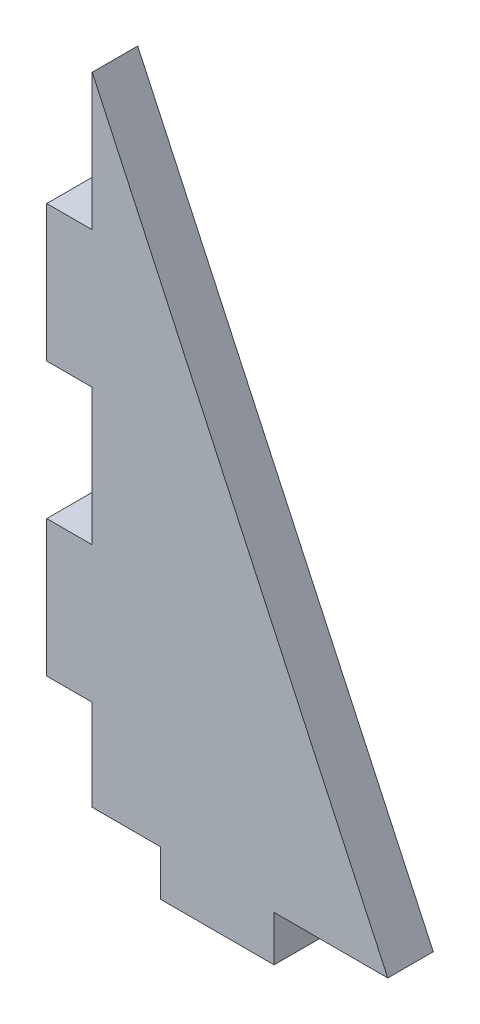
ISO-10303-21;
HEADER;
FILE_DESCRIPTION(('STEP AP214'),'2;1');
FILE_NAME('part.step','',(''),(''),'','','');
FILE_SCHEMA(('AUTOMOTIVE_DESIGN { 1 0 10303 214 1 1 1 1 }'));
ENDSEC;
DATA;
#1=APPLICATION_CONTEXT('core data for automotive mechanical design processes');
#2=APPLICATION_PROTOCOL_DEFINITION('international standard','automotive_design',2000,#1);
#3=PRODUCT_CONTEXT('',#1,'mechanical');
#4=PRODUCT('Part','Part','',(#3));
#5=PRODUCT_RELATED_PRODUCT_CATEGORY('part','',(#4));
#6=PRODUCT_DEFINITION_FORMATION('','',#4);
#7=PRODUCT_DEFINITION_CONTEXT('part definition',#1,'design');
#8=PRODUCT_DEFINITION('design','',#6,#7);
#9=PRODUCT_DEFINITION_SHAPE('','',#8);
#10=(LENGTH_UNIT() NAMED_UNIT(*) SI_UNIT(.MILLI.,.METRE.));
#11=(NAMED_UNIT(*) PLANE_ANGLE_UNIT() SI_UNIT($,.RADIAN.));
#12=(NAMED_UNIT(*) SI_UNIT($,.STERADIAN.) SOLID_ANGLE_UNIT());
#13=UNCERTAINTY_MEASURE_WITH_UNIT(LENGTH_MEASURE(1.E-05),#10,'distance_accuracy_value','');
#14=(GEOMETRIC_REPRESENTATION_CONTEXT(3) GLOBAL_UNCERTAINTY_ASSIGNED_CONTEXT((#13)) GLOBAL_UNIT_ASSIGNED_CONTEXT((#10,
#11,#12)) REPRESENTATION_CONTEXT('',''));
#15=CARTESIAN_POINT('',(0.,0.,0.));
#16=DIRECTION('',(0.,0.,1.));
#17=DIRECTION('',(1.,0.,0.));
#18=AXIS2_PLACEMENT_3D('',#15,#16,#17);
#19=CARTESIAN_POINT('',(38.1,0.,5.08));
#20=DIRECTION('',(0.,1.,0.));
#21=DIRECTION('',(-1.,0.,0.));
#22=AXIS2_PLACEMENT_3D('',#19,#20,#21);
#23=PLANE('',#22);
#24=DIRECTION('',(0.,0.,1.));
#25=VECTOR('',#24,1.);
#26=CARTESIAN_POINT('',(12.7,0.,0.));
#27=LINE('',#26,#25);
#28=CARTESIAN_POINT('',(12.7,0.,0.));
#29=VERTEX_POINT('',#28);
#30=CARTESIAN_POINT('',(12.7,0.,5.07999999999999));
#31=VERTEX_POINT('',#30);
#32=EDGE_CURVE('E202',#29,#31,#27,.T.);
#33=ORIENTED_EDGE('',*,*,#32,.F.);
#34=DIRECTION('',(1.,0.,0.));
#35=VECTOR('',#34,1.);
#36=CARTESIAN_POINT('',(38.1,0.,0.));
#37=LINE('',#36,#35);
#38=CARTESIAN_POINT('',(25.4,0.,0.));
#39=VERTEX_POINT('',#38);
#40=EDGE_CURVE('E169',#29,#39,#37,.T.);
#41=ORIENTED_EDGE('',*,*,#40,.T.);
#42=DIRECTION('',(0.,0.,1.));
#43=VECTOR('',#42,1.);
#44=CARTESIAN_POINT('',(25.4,0.,0.));
#45=LINE('',#44,#43);
#46=CARTESIAN_POINT('',(25.4,0.,5.08));
#47=VERTEX_POINT('',#46);
#48=EDGE_CURVE('E207',#39,#47,#45,.T.);
#49=ORIENTED_EDGE('',*,*,#48,.T.);
#50=DIRECTION('',(1.,0.,0.));
#51=VECTOR('',#50,1.);
#52=CARTESIAN_POINT('',(38.1,0.,5.08));
#53=LINE('',#52,#51);
#54=EDGE_CURVE('E238',#31,#47,#53,.T.);
#55=ORIENTED_EDGE('',*,*,#54,.F.);
#56=EDGE_LOOP('',(#33,#41,#49,#55));
#57=FACE_BOUND('',#56,.T.);
#58=ADVANCED_FACE('F32',(#57),#23,.F.);
#59=CARTESIAN_POINT('',(0.,0.,5.08));
#60=DIRECTION('',(1.,0.,0.));
#61=DIRECTION('',(0.,0.,-1.));
#62=AXIS2_PLACEMENT_3D('',#59,#60,#61);
#63=PLANE('',#62);
#64=DIRECTION('',(0.,0.,1.));
#65=VECTOR('',#64,1.);
#66=CARTESIAN_POINT('',(0.,60.96,0.));
#67=LINE('',#66,#65);
#68=CARTESIAN_POINT('',(0.,60.96,0.));
#69=VERTEX_POINT('',#68);
#70=CARTESIAN_POINT('',(0.,60.96,5.08));
#71=VERTEX_POINT('',#70);
#72=EDGE_CURVE('E157',#69,#71,#67,.T.);
#73=ORIENTED_EDGE('',*,*,#72,.F.);
#74=DIRECTION('',(0.,-1.,0.));
#75=VECTOR('',#74,1.);
#76=CARTESIAN_POINT('',(0.,0.,0.));
#77=LINE('',#76,#75);
#78=CARTESIAN_POINT('',(0.,45.72,0.));
#79=VERTEX_POINT('',#78);
#80=EDGE_CURVE('E162',#69,#79,#77,.T.);
#81=ORIENTED_EDGE('',*,*,#80,.T.);
#82=DIRECTION('',(0.,0.,1.));
#83=VECTOR('',#82,1.);
#84=CARTESIAN_POINT('',(0.,45.72,0.));
#85=LINE('',#84,#83);
#86=CARTESIAN_POINT('',(0.,45.72,5.08));
#87=VERTEX_POINT('',#86);
#88=EDGE_CURVE('E54',#79,#87,#85,.T.);
#89=ORIENTED_EDGE('',*,*,#88,.T.);
#90=DIRECTION('',(0.,-1.,0.));
#91=VECTOR('',#90,1.);
#92=CARTESIAN_POINT('',(0.,0.,5.08));
#93=LINE('',#92,#91);
#94=EDGE_CURVE('E247',#71,#87,#93,.T.);
#95=ORIENTED_EDGE('',*,*,#94,.F.);
#96=EDGE_LOOP('',(#73,#81,#89,#95));
#97=FACE_BOUND('',#96,.T.);
#98=ADVANCED_FACE('F260',(#97),#63,.F.);
#99=DIRECTION('',(0.,0.,1.));
#100=VECTOR('',#99,1.);
#101=CARTESIAN_POINT('',(0.,30.48,0.));
#102=LINE('',#101,#100);
#103=CARTESIAN_POINT('',(0.,30.48,0.));
#104=VERTEX_POINT('',#103);
#105=CARTESIAN_POINT('',(0.,30.48,5.08000000000002));
#106=VERTEX_POINT('',#105);
#107=EDGE_CURVE('E189',#104,#106,#102,.T.);
#108=ORIENTED_EDGE('',*,*,#107,.F.);
#109=CARTESIAN_POINT('',(0.,15.24,0.));
#110=VERTEX_POINT('',#109);
#111=EDGE_CURVE('E252',#104,#110,#77,.T.);
#112=ORIENTED_EDGE('',*,*,#111,.T.);
#113=DIRECTION('',(0.,0.,1.));
#114=VECTOR('',#113,1.);
#115=CARTESIAN_POINT('',(0.,15.24,0.));
#116=LINE('',#115,#114);
#117=CARTESIAN_POINT('',(0.,15.24,5.08));
#118=VERTEX_POINT('',#117);
#119=EDGE_CURVE('E183',#110,#118,#116,.T.);
#120=ORIENTED_EDGE('',*,*,#119,.T.);
#121=EDGE_CURVE('E244',#106,#118,#93,.T.);
#122=ORIENTED_EDGE('',*,*,#121,.F.);
#123=EDGE_LOOP('',(#108,#112,#120,#122));
#124=FACE_BOUND('',#123,.T.);
#125=ADVANCED_FACE('F262',(#124),#63,.F.);
#126=CARTESIAN_POINT('',(0.,0.,5.08));
#127=DIRECTION('',(0.,0.,-1.));
#128=DIRECTION('',(-1.,0.,0.));
#129=AXIS2_PLACEMENT_3D('',#126,#127,#128);
#130=PLANE('',#129);
#131=DIRECTION('',(-1.,0.,0.));
#132=VECTOR('',#131,1.);
#133=CARTESIAN_POINT('',(0.,60.96,5.08));
#134=LINE('',#133,#132);
#135=CARTESIAN_POINT('',(5.08,60.96,5.07999999999998));
#136=VERTEX_POINT('',#135);
#137=EDGE_CURVE('E155',#136,#71,#134,.T.);
#138=ORIENTED_EDGE('',*,*,#137,.T.);
#139=ORIENTED_EDGE('',*,*,#94,.T.);
#140=DIRECTION('',(-1.,0.,0.));
#141=VECTOR('',#140,1.);
#142=CARTESIAN_POINT('',(0.,45.72,5.08));
#143=LINE('',#142,#141);
#144=CARTESIAN_POINT('',(5.08,45.72,5.07999999999996));
#145=VERTEX_POINT('',#144);
#146=EDGE_CURVE('E182',#145,#87,#143,.T.);
#147=ORIENTED_EDGE('',*,*,#146,.F.);
#148=DIRECTION('',(0.,-1.,0.));
#149=VECTOR('',#148,1.);
#150=CARTESIAN_POINT('',(5.08000000000001,0.,5.07999999999999));
#151=LINE('',#150,#149);
#152=CARTESIAN_POINT('',(5.08000000000001,30.48,5.08));
#153=VERTEX_POINT('',#152);
#154=EDGE_CURVE('E179',#145,#153,#151,.T.);
#155=ORIENTED_EDGE('',*,*,#154,.T.);
#156=DIRECTION('',(-1.,0.,0.));
#157=VECTOR('',#156,1.);
#158=CARTESIAN_POINT('',(0.,30.48,5.08000000000002));
#159=LINE('',#158,#157);
#160=EDGE_CURVE('E174',#153,#106,#159,.T.);
#161=ORIENTED_EDGE('',*,*,#160,.T.);
#162=ORIENTED_EDGE('',*,*,#121,.T.);
#163=DIRECTION('',(-1.,0.,0.));
#164=VECTOR('',#163,1.);
#165=CARTESIAN_POINT('',(0.,15.24,5.08));
#166=LINE('',#165,#164);
#167=CARTESIAN_POINT('',(5.08,15.24,5.08));
#168=VERTEX_POINT('',#167);
#169=EDGE_CURVE('E195',#168,#118,#166,.T.);
#170=ORIENTED_EDGE('',*,*,#169,.F.);
#171=DIRECTION('',(0.,-1.,0.));
#172=VECTOR('',#171,1.);
#173=CARTESIAN_POINT('',(5.07999999999999,0.,5.07999999999999));
#174=LINE('',#173,#172);
#175=CARTESIAN_POINT('',(5.08,5.08,5.07999999999999));
#176=VERTEX_POINT('',#175);
#177=EDGE_CURVE('E210',#168,#176,#174,.T.);
#178=ORIENTED_EDGE('',*,*,#177,.T.);
#179=DIRECTION('',(-1.,0.,0.));
#180=VECTOR('',#179,1.);
#181=CARTESIAN_POINT('',(0.,5.08,5.08));
#182=LINE('',#181,#180);
#183=CARTESIAN_POINT('',(12.7,5.07999999999999,5.08));
#184=VERTEX_POINT('',#183);
#185=EDGE_CURVE('E206',#184,#176,#182,.T.);
#186=ORIENTED_EDGE('',*,*,#185,.F.);
#187=DIRECTION('',(0.,-1.,0.));
#188=VECTOR('',#187,1.);
#189=CARTESIAN_POINT('',(12.7,0.,5.07999999999999));
#190=LINE('',#189,#188);
#191=EDGE_CURVE('E203',#184,#31,#190,.T.);
#192=ORIENTED_EDGE('',*,*,#191,.T.);
#193=ORIENTED_EDGE('',*,*,#54,.T.);
#194=DIRECTION('',(0.,-1.,0.));
#195=VECTOR('',#194,1.);
#196=CARTESIAN_POINT('',(25.4,0.,5.08));
#197=LINE('',#196,#195);
#198=CARTESIAN_POINT('',(25.4,5.07999999999999,5.08));
#199=VERTEX_POINT('',#198);
#200=EDGE_CURVE('E227',#199,#47,#197,.T.);
#201=ORIENTED_EDGE('',*,*,#200,.F.);
#202=DIRECTION('',(-1.,0.,0.));
#203=VECTOR('',#202,1.);
#204=CARTESIAN_POINT('',(0.,5.07999999999999,5.08));
#205=LINE('',#204,#203);
#206=CARTESIAN_POINT('',(38.1,5.07999999999996,5.08));
#207=VERTEX_POINT('',#206);
#208=EDGE_CURVE('E231',#207,#199,#205,.T.);
#209=ORIENTED_EDGE('',*,*,#208,.F.);
#210=DIRECTION('',(-0.421111306454629,0.907008967748432,0.));
#211=VECTOR('',#210,1.);
#212=CARTESIAN_POINT('',(5.07999999999999,76.2,5.08));
#213=LINE('',#212,#211);
#214=CARTESIAN_POINT('',(5.07999999999999,76.2,5.08));
#215=VERTEX_POINT('',#214);
#216=EDGE_CURVE('E241',#207,#215,#213,.T.);
#217=ORIENTED_EDGE('',*,*,#216,.T.);
#218=DIRECTION('',(0.,-1.,0.));
#219=VECTOR('',#218,1.);
#220=CARTESIAN_POINT('',(5.08,0.,5.07999999999999));
#221=LINE('',#220,#219);
#222=EDGE_CURVE('E163',#215,#136,#221,.T.);
#223=ORIENTED_EDGE('',*,*,#222,.T.);
#224=EDGE_LOOP('',(#138,#139,#147,#155,#161,#162,#170,#178,#186,#192,#193,#201,#209,#217,#223));
#225=FACE_BOUND('',#224,.T.);
#226=ADVANCED_FACE('F258',(#225),#130,.F.);
#227=CARTESIAN_POINT('',(0.,0.,0.));
#228=DIRECTION('',(0.,0.,-1.));
#229=DIRECTION('',(-1.,0.,0.));
#230=AXIS2_PLACEMENT_3D('',#227,#228,#229);
#231=PLANE('',#230);
#232=ORIENTED_EDGE('',*,*,#80,.F.);
#233=DIRECTION('',(-1.,0.,0.));
#234=VECTOR('',#233,1.);
#235=CARTESIAN_POINT('',(0.,60.96,0.));
#236=LINE('',#235,#234);
#237=CARTESIAN_POINT('',(5.08,60.96,0.));
#238=VERTEX_POINT('',#237);
#239=EDGE_CURVE('E149',#238,#69,#236,.T.);
#240=ORIENTED_EDGE('',*,*,#239,.F.);
#241=DIRECTION('',(0.,-1.,0.));
#242=VECTOR('',#241,1.);
#243=CARTESIAN_POINT('',(5.08000000000001,0.,0.));
#244=LINE('',#243,#242);
#245=CARTESIAN_POINT('',(5.08,76.2,0.));
#246=VERTEX_POINT('',#245);
#247=EDGE_CURVE('E139',#246,#238,#244,.T.);
#248=ORIENTED_EDGE('',*,*,#247,.F.);
#249=DIRECTION('',(-0.421111306454629,0.907008967748432,0.));
#250=VECTOR('',#249,1.);
#251=CARTESIAN_POINT('',(5.08,76.2,0.));
#252=LINE('',#251,#250);
#253=CARTESIAN_POINT('',(38.1,5.07999999999999,0.));
#254=VERTEX_POINT('',#253);
#255=EDGE_CURVE('E250',#254,#246,#252,.T.);
#256=ORIENTED_EDGE('',*,*,#255,.F.);
#257=DIRECTION('',(-1.,0.,0.));
#258=VECTOR('',#257,1.);
#259=CARTESIAN_POINT('',(0.,5.07999999999999,0.));
#260=LINE('',#259,#258);
#261=CARTESIAN_POINT('',(25.4,5.07999999999999,0.));
#262=VERTEX_POINT('',#261);
#263=EDGE_CURVE('E223',#254,#262,#260,.T.);
#264=ORIENTED_EDGE('',*,*,#263,.T.);
#265=DIRECTION('',(0.,-1.,0.));
#266=VECTOR('',#265,1.);
#267=CARTESIAN_POINT('',(25.4,0.,0.));
#268=LINE('',#267,#266);
#269=EDGE_CURVE('E226',#262,#39,#268,.T.);
#270=ORIENTED_EDGE('',*,*,#269,.T.);
#271=ORIENTED_EDGE('',*,*,#40,.F.);
#272=DIRECTION('',(0.,-1.,0.));
#273=VECTOR('',#272,1.);
#274=CARTESIAN_POINT('',(12.7,0.,0.));
#275=LINE('',#274,#273);
#276=CARTESIAN_POINT('',(12.7,5.07999999999999,0.));
#277=VERTEX_POINT('',#276);
#278=EDGE_CURVE('E193',#277,#29,#275,.T.);
#279=ORIENTED_EDGE('',*,*,#278,.F.);
#280=DIRECTION('',(-1.,0.,0.));
#281=VECTOR('',#280,1.);
#282=CARTESIAN_POINT('',(0.,5.08,0.));
#283=LINE('',#282,#281);
#284=CARTESIAN_POINT('',(5.08,5.08,0.));
#285=VERTEX_POINT('',#284);
#286=EDGE_CURVE('E46',#277,#285,#283,.T.);
#287=ORIENTED_EDGE('',*,*,#286,.T.);
#288=DIRECTION('',(0.,-1.,0.));
#289=VECTOR('',#288,1.);
#290=CARTESIAN_POINT('',(5.08,0.,0.));
#291=LINE('',#290,#289);
#292=CARTESIAN_POINT('',(5.08,15.24,0.));
#293=VERTEX_POINT('',#292);
#294=EDGE_CURVE('E197',#293,#285,#291,.T.);
#295=ORIENTED_EDGE('',*,*,#294,.F.);
#296=DIRECTION('',(-1.,0.,0.));
#297=VECTOR('',#296,1.);
#298=CARTESIAN_POINT('',(0.,15.24,0.));
#299=LINE('',#298,#297);
#300=EDGE_CURVE('E199',#293,#110,#299,.T.);
#301=ORIENTED_EDGE('',*,*,#300,.T.);
#302=ORIENTED_EDGE('',*,*,#111,.F.);
#303=DIRECTION('',(-1.,0.,0.));
#304=VECTOR('',#303,1.);
#305=CARTESIAN_POINT('',(0.,30.48,0.));
#306=LINE('',#305,#304);
#307=CARTESIAN_POINT('',(5.08000000000001,30.48,0.));
#308=VERTEX_POINT('',#307);
#309=EDGE_CURVE('E176',#308,#104,#306,.T.);
#310=ORIENTED_EDGE('',*,*,#309,.F.);
#311=DIRECTION('',(0.,-1.,0.));
#312=VECTOR('',#311,1.);
#313=CARTESIAN_POINT('',(5.08000000000001,0.,0.));
#314=LINE('',#313,#312);
#315=CARTESIAN_POINT('',(5.08,45.72,0.));
#316=VERTEX_POINT('',#315);
#317=EDGE_CURVE('E171',#316,#308,#314,.T.);
#318=ORIENTED_EDGE('',*,*,#317,.F.);
#319=DIRECTION('',(-1.,0.,0.));
#320=VECTOR('',#319,1.);
#321=CARTESIAN_POINT('',(0.,45.72,0.));
#322=LINE('',#321,#320);
#323=EDGE_CURVE('E173',#316,#79,#322,.T.);
#324=ORIENTED_EDGE('',*,*,#323,.T.);
#325=EDGE_LOOP('',(#232,#240,#248,#256,#264,#270,#271,#279,#287,#295,#301,#302,#310,#318,#324));
#326=FACE_BOUND('',#325,.T.);
#327=ADVANCED_FACE('F160',(#326),#231,.T.);
#328=CARTESIAN_POINT('',(5.07999999999999,76.2,5.08));
#329=DIRECTION('',(-0.907008967748432,-0.421111306454629,0.));
#330=DIRECTION('',(0.421111306454629,-0.907008967748432,0.));
#331=AXIS2_PLACEMENT_3D('',#328,#329,#330);
#332=PLANE('',#331);
#333=ORIENTED_EDGE('',*,*,#255,.T.);
#334=DIRECTION('',(0.,0.,-1.));
#335=VECTOR('',#334,1.);
#336=CARTESIAN_POINT('',(5.07999999999999,76.2,5.08));
#337=LINE('',#336,#335);
#338=EDGE_CURVE('E39',#215,#246,#337,.T.);
#339=ORIENTED_EDGE('',*,*,#338,.F.);
#340=ORIENTED_EDGE('',*,*,#216,.F.);
#341=DIRECTION('',(0.,0.,-1.));
#342=VECTOR('',#341,1.);
#343=CARTESIAN_POINT('',(38.1,5.07999999999996,5.08));
#344=LINE('',#343,#342);
#345=EDGE_CURVE('E11',#207,#254,#344,.T.);
#346=ORIENTED_EDGE('',*,*,#345,.T.);
#347=EDGE_LOOP('',(#333,#339,#340,#346));
#348=FACE_BOUND('',#347,.T.);
#349=ADVANCED_FACE('F272',(#348),#332,.F.);
#350=CARTESIAN_POINT('',(0.,5.07999999999999,0.));
#351=DIRECTION('',(0.,1.,0.));
#352=DIRECTION('',(-1.,0.,0.));
#353=AXIS2_PLACEMENT_3D('',#350,#351,#352);
#354=PLANE('',#353);
#355=ORIENTED_EDGE('',*,*,#208,.T.);
#356=DIRECTION('',(0.,0.,1.));
#357=VECTOR('',#356,1.);
#358=CARTESIAN_POINT('',(25.4,5.07999999999999,0.));
#359=LINE('',#358,#357);
#360=EDGE_CURVE('E230',#262,#199,#359,.T.);
#361=ORIENTED_EDGE('',*,*,#360,.F.);
#362=ORIENTED_EDGE('',*,*,#263,.F.);
#363=ORIENTED_EDGE('',*,*,#345,.F.);
#364=EDGE_LOOP('',(#355,#361,#362,#363));
#365=FACE_BOUND('',#364,.T.);
#366=ADVANCED_FACE('F274',(#365),#354,.F.);
#367=CARTESIAN_POINT('',(25.4,0.,0.));
#368=DIRECTION('',(-1.,0.,0.));
#369=DIRECTION('',(0.,-1.,0.));
#370=AXIS2_PLACEMENT_3D('',#367,#368,#369);
#371=PLANE('',#370);
#372=ORIENTED_EDGE('',*,*,#200,.T.);
#373=ORIENTED_EDGE('',*,*,#48,.F.);
#374=ORIENTED_EDGE('',*,*,#269,.F.);
#375=ORIENTED_EDGE('',*,*,#360,.T.);
#376=EDGE_LOOP('',(#372,#373,#374,#375));
#377=FACE_BOUND('',#376,.T.);
#378=ADVANCED_FACE('F280',(#377),#371,.F.);
#379=CARTESIAN_POINT('',(0.,15.24,0.));
#380=DIRECTION('',(0.,1.,0.));
#381=DIRECTION('',(-1.,0.,0.));
#382=AXIS2_PLACEMENT_3D('',#379,#380,#381);
#383=PLANE('',#382);
#384=ORIENTED_EDGE('',*,*,#169,.T.);
#385=ORIENTED_EDGE('',*,*,#119,.F.);
#386=ORIENTED_EDGE('',*,*,#300,.F.);
#387=DIRECTION('',(0.,0.,1.));
#388=VECTOR('',#387,1.);
#389=CARTESIAN_POINT('',(5.08,15.24,0.));
#390=LINE('',#389,#388);
#391=EDGE_CURVE('E216',#293,#168,#390,.T.);
#392=ORIENTED_EDGE('',*,*,#391,.T.);
#393=EDGE_LOOP('',(#384,#385,#386,#392));
#394=FACE_BOUND('',#393,.T.);
#395=ADVANCED_FACE('F306',(#394),#383,.F.);
#396=CARTESIAN_POINT('',(5.08,0.,0.));
#397=DIRECTION('',(-1.,0.,0.));
#398=DIRECTION('',(0.,-1.,0.));
#399=AXIS2_PLACEMENT_3D('',#396,#397,#398);
#400=PLANE('',#399);
#401=ORIENTED_EDGE('',*,*,#177,.F.);
#402=ORIENTED_EDGE('',*,*,#391,.F.);
#403=ORIENTED_EDGE('',*,*,#294,.T.);
#404=DIRECTION('',(0.,0.,1.));
#405=VECTOR('',#404,1.);
#406=CARTESIAN_POINT('',(5.08,5.08,0.));
#407=LINE('',#406,#405);
#408=EDGE_CURVE('E218',#285,#176,#407,.T.);
#409=ORIENTED_EDGE('',*,*,#408,.T.);
#410=EDGE_LOOP('',(#401,#402,#403,#409));
#411=FACE_BOUND('',#410,.T.);
#412=ADVANCED_FACE('F301',(#411),#400,.T.);
#413=CARTESIAN_POINT('',(0.,5.08,0.));
#414=DIRECTION('',(0.,1.,0.));
#415=DIRECTION('',(-1.,0.,0.));
#416=AXIS2_PLACEMENT_3D('',#413,#414,#415);
#417=PLANE('',#416);
#418=ORIENTED_EDGE('',*,*,#185,.T.);
#419=ORIENTED_EDGE('',*,*,#408,.F.);
#420=ORIENTED_EDGE('',*,*,#286,.F.);
#421=DIRECTION('',(0.,0.,1.));
#422=VECTOR('',#421,1.);
#423=CARTESIAN_POINT('',(12.7,5.07999999999999,0.));
#424=LINE('',#423,#422);
#425=EDGE_CURVE('E220',#277,#184,#424,.T.);
#426=ORIENTED_EDGE('',*,*,#425,.T.);
#427=EDGE_LOOP('',(#418,#419,#420,#426));
#428=FACE_BOUND('',#427,.T.);
#429=ADVANCED_FACE('F302',(#428),#417,.F.);
#430=CARTESIAN_POINT('',(12.7,0.,0.));
#431=DIRECTION('',(-1.,0.,0.));
#432=DIRECTION('',(0.,0.,1.));
#433=AXIS2_PLACEMENT_3D('',#430,#431,#432);
#434=PLANE('',#433);
#435=ORIENTED_EDGE('',*,*,#191,.F.);
#436=ORIENTED_EDGE('',*,*,#425,.F.);
#437=ORIENTED_EDGE('',*,*,#278,.T.);
#438=ORIENTED_EDGE('',*,*,#32,.T.);
#439=EDGE_LOOP('',(#435,#436,#437,#438));
#440=FACE_BOUND('',#439,.T.);
#441=ADVANCED_FACE('F294',(#440),#434,.T.);
#442=CARTESIAN_POINT('',(5.08000000000001,0.,0.));
#443=DIRECTION('',(-1.,0.,0.));
#444=DIRECTION('',(0.,-1.,0.));
#445=AXIS2_PLACEMENT_3D('',#442,#443,#444);
#446=PLANE('',#445);
#447=ORIENTED_EDGE('',*,*,#154,.F.);
#448=DIRECTION('',(0.,0.,1.));
#449=VECTOR('',#448,1.);
#450=CARTESIAN_POINT('',(5.08,45.72,0.));
#451=LINE('',#450,#449);
#452=EDGE_CURVE('E178',#316,#145,#451,.T.);
#453=ORIENTED_EDGE('',*,*,#452,.F.);
#454=ORIENTED_EDGE('',*,*,#317,.T.);
#455=DIRECTION('',(0.,0.,1.));
#456=VECTOR('',#455,1.);
#457=CARTESIAN_POINT('',(5.08000000000001,30.48,0.));
#458=LINE('',#457,#456);
#459=EDGE_CURVE('E167',#308,#153,#458,.T.);
#460=ORIENTED_EDGE('',*,*,#459,.T.);
#461=EDGE_LOOP('',(#447,#453,#454,#460));
#462=FACE_BOUND('',#461,.T.);
#463=ADVANCED_FACE('F315',(#462),#446,.T.);
#464=CARTESIAN_POINT('',(0.,30.48,0.));
#465=DIRECTION('',(0.,1.,0.));
#466=DIRECTION('',(0.,0.,1.));
#467=AXIS2_PLACEMENT_3D('',#464,#465,#466);
#468=PLANE('',#467);
#469=ORIENTED_EDGE('',*,*,#160,.F.);
#470=ORIENTED_EDGE('',*,*,#459,.F.);
#471=ORIENTED_EDGE('',*,*,#309,.T.);
#472=ORIENTED_EDGE('',*,*,#107,.T.);
#473=EDGE_LOOP('',(#469,#470,#471,#472));
#474=FACE_BOUND('',#473,.T.);
#475=ADVANCED_FACE('F312',(#474),#468,.T.);
#476=CARTESIAN_POINT('',(0.,45.72,0.));
#477=DIRECTION('',(0.,1.,0.));
#478=DIRECTION('',(0.,0.,1.));
#479=AXIS2_PLACEMENT_3D('',#476,#477,#478);
#480=PLANE('',#479);
#481=ORIENTED_EDGE('',*,*,#146,.T.);
#482=ORIENTED_EDGE('',*,*,#88,.F.);
#483=ORIENTED_EDGE('',*,*,#323,.F.);
#484=ORIENTED_EDGE('',*,*,#452,.T.);
#485=EDGE_LOOP('',(#481,#482,#483,#484));
#486=FACE_BOUND('',#485,.T.);
#487=ADVANCED_FACE('F316',(#486),#480,.F.);
#488=CARTESIAN_POINT('',(0.,60.96,0.));
#489=DIRECTION('',(0.,1.,0.));
#490=DIRECTION('',(0.,0.,1.));
#491=AXIS2_PLACEMENT_3D('',#488,#489,#490);
#492=PLANE('',#491);
#493=ORIENTED_EDGE('',*,*,#137,.F.);
#494=DIRECTION('',(0.,0.,1.));
#495=VECTOR('',#494,1.);
#496=CARTESIAN_POINT('',(5.08,60.96,0.));
#497=LINE('',#496,#495);
#498=EDGE_CURVE('E142',#238,#136,#497,.T.);
#499=ORIENTED_EDGE('',*,*,#498,.F.);
#500=ORIENTED_EDGE('',*,*,#239,.T.);
#501=ORIENTED_EDGE('',*,*,#72,.T.);
#502=EDGE_LOOP('',(#493,#499,#500,#501));
#503=FACE_BOUND('',#502,.T.);
#504=ADVANCED_FACE('F152',(#503),#492,.T.);
#505=CARTESIAN_POINT('',(5.08000000000001,0.,0.));
#506=DIRECTION('',(-1.,0.,0.));
#507=DIRECTION('',(0.,-1.,0.));
#508=AXIS2_PLACEMENT_3D('',#505,#506,#507);
#509=PLANE('',#508);
#510=ORIENTED_EDGE('',*,*,#222,.F.);
#511=ORIENTED_EDGE('',*,*,#338,.T.);
#512=ORIENTED_EDGE('',*,*,#247,.T.);
#513=ORIENTED_EDGE('',*,*,#498,.T.);
#514=EDGE_LOOP('',(#510,#511,#512,#513));
#515=FACE_BOUND('',#514,.T.);
#516=ADVANCED_FACE('F141',(#515),#509,.T.);
#517=CLOSED_SHELL('',(#58,#98,#125,#226,#327,#349,#366,#378,#395,#412,#429,#441,#463,#475,#487,
#504,#516));
#518=MANIFOLD_SOLID_BREP('B2',#517);
#519=ADVANCED_BREP_SHAPE_REPRESENTATION('',(#18,#518),#14);
#520=SHAPE_DEFINITION_REPRESENTATION(#9,#519);
ENDSEC;
END-ISO-10303-21;
